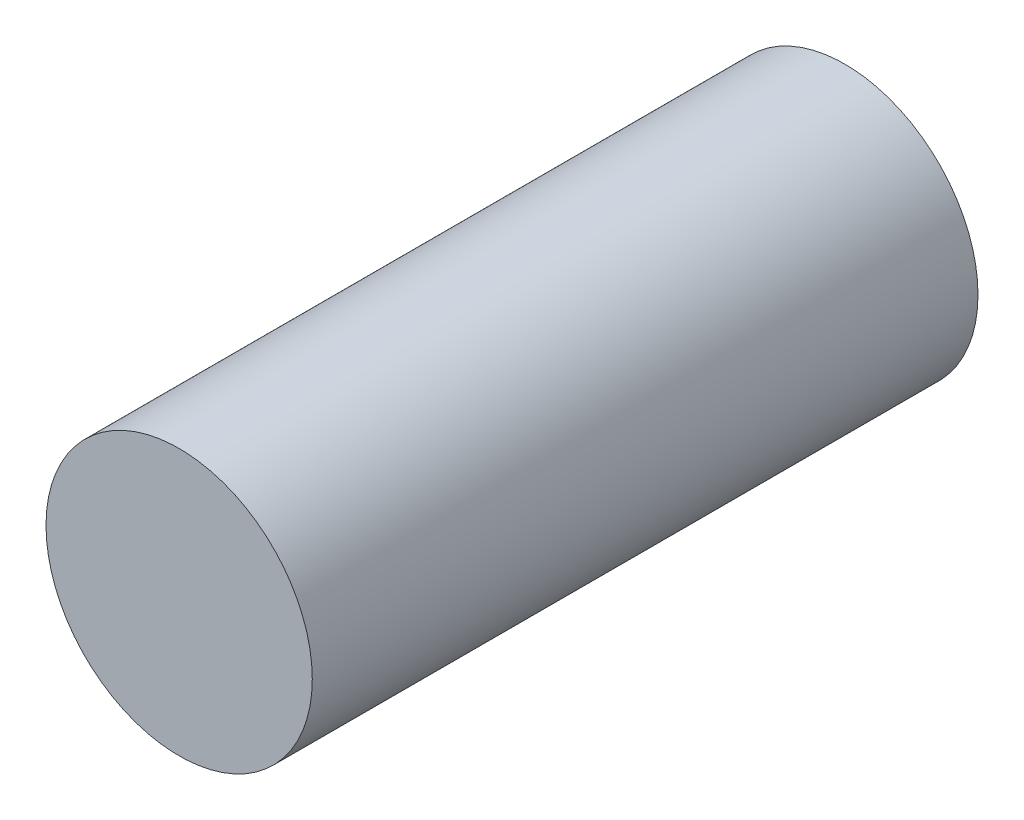
ISO-10303-21;
HEADER;
FILE_DESCRIPTION(('STEP AP214'),'2;1');
FILE_NAME('part.step','',(''),(''),'','','');
FILE_SCHEMA(('AUTOMOTIVE_DESIGN { 1 0 10303 214 1 1 1 1 }'));
ENDSEC;
DATA;
#1=APPLICATION_CONTEXT('core data for automotive mechanical design processes');
#2=APPLICATION_PROTOCOL_DEFINITION('international standard','automotive_design',2000,#1);
#3=PRODUCT_CONTEXT('',#1,'mechanical');
#4=PRODUCT('Part','Part','',(#3));
#5=PRODUCT_RELATED_PRODUCT_CATEGORY('part','',(#4));
#6=PRODUCT_DEFINITION_FORMATION('','',#4);
#7=PRODUCT_DEFINITION_CONTEXT('part definition',#1,'design');
#8=PRODUCT_DEFINITION('design','',#6,#7);
#9=PRODUCT_DEFINITION_SHAPE('','',#8);
#10=(LENGTH_UNIT() NAMED_UNIT(*) SI_UNIT(.MILLI.,.METRE.));
#11=(NAMED_UNIT(*) PLANE_ANGLE_UNIT() SI_UNIT($,.RADIAN.));
#12=(NAMED_UNIT(*) SI_UNIT($,.STERADIAN.) SOLID_ANGLE_UNIT());
#13=UNCERTAINTY_MEASURE_WITH_UNIT(LENGTH_MEASURE(1.E-05),#10,'distance_accuracy_value','');
#14=(GEOMETRIC_REPRESENTATION_CONTEXT(3) GLOBAL_UNCERTAINTY_ASSIGNED_CONTEXT((#13)) GLOBAL_UNIT_ASSIGNED_CONTEXT((#10,
#11,#12)) REPRESENTATION_CONTEXT('',''));
#15=CARTESIAN_POINT('',(0.,0.,0.));
#16=DIRECTION('',(0.,0.,1.));
#17=DIRECTION('',(1.,0.,0.));
#18=AXIS2_PLACEMENT_3D('',#15,#16,#17);
#19=CARTESIAN_POINT('',(0.,0.,60.));
#20=DIRECTION('',(0.,0.,-1.));
#21=DIRECTION('',(-1.,0.,0.));
#22=AXIS2_PLACEMENT_3D('',#19,#20,#21);
#23=CYLINDRICAL_SURFACE('',#22,12.);
#24=CARTESIAN_POINT('',(0.,0.,60.));
#25=DIRECTION('',(0.,0.,1.));
#26=DIRECTION('',(1.,0.,0.));
#27=AXIS2_PLACEMENT_3D('',#24,#25,#26);
#28=CIRCLE('',#27,12.);
#29=CARTESIAN_POINT('',(12.,0.,60.));
#30=VERTEX_POINT('',#29);
#31=EDGE_CURVE('E10',#30,#30,#28,.T.);
#32=ORIENTED_EDGE('',*,*,#31,.F.);
#33=EDGE_LOOP('',(#32));
#34=FACE_BOUND('',#33,.T.);
#35=CARTESIAN_POINT('',(0.,0.,0.));
#36=DIRECTION('',(0.,0.,1.));
#37=DIRECTION('',(1.,0.,0.));
#38=AXIS2_PLACEMENT_3D('',#35,#36,#37);
#39=CIRCLE('',#38,12.);
#40=CARTESIAN_POINT('',(12.,0.,0.));
#41=VERTEX_POINT('',#40);
#42=EDGE_CURVE('E40',#41,#41,#39,.T.);
#43=ORIENTED_EDGE('',*,*,#42,.T.);
#44=EDGE_LOOP('',(#43));
#45=FACE_BOUND('',#44,.T.);
#46=ADVANCED_FACE('F37',(#34,#45),#23,.T.);
#47=CARTESIAN_POINT('',(0.,0.,60.));
#48=DIRECTION('',(0.,0.,1.));
#49=DIRECTION('',(1.,0.,0.));
#50=AXIS2_PLACEMENT_3D('',#47,#48,#49);
#51=PLANE('',#50);
#52=ORIENTED_EDGE('',*,*,#31,.T.);
#53=EDGE_LOOP('',(#52));
#54=FACE_BOUND('',#53,.T.);
#55=ADVANCED_FACE('F54',(#54),#51,.T.);
#56=CARTESIAN_POINT('',(0.,0.,0.));
#57=DIRECTION('',(0.,0.,1.));
#58=DIRECTION('',(1.,0.,0.));
#59=AXIS2_PLACEMENT_3D('',#56,#57,#58);
#60=PLANE('',#59);
#61=ORIENTED_EDGE('',*,*,#42,.F.);
#62=EDGE_LOOP('',(#61));
#63=FACE_BOUND('',#62,.T.);
#64=ADVANCED_FACE('F52',(#63),#60,.F.);
#65=CLOSED_SHELL('',(#46,#55,#64));
#66=MANIFOLD_SOLID_BREP('B2',#65);
#67=ADVANCED_BREP_SHAPE_REPRESENTATION('',(#18,#66),#14);
#68=SHAPE_DEFINITION_REPRESENTATION(#9,#67);
ENDSEC;
END-ISO-10303-21;
